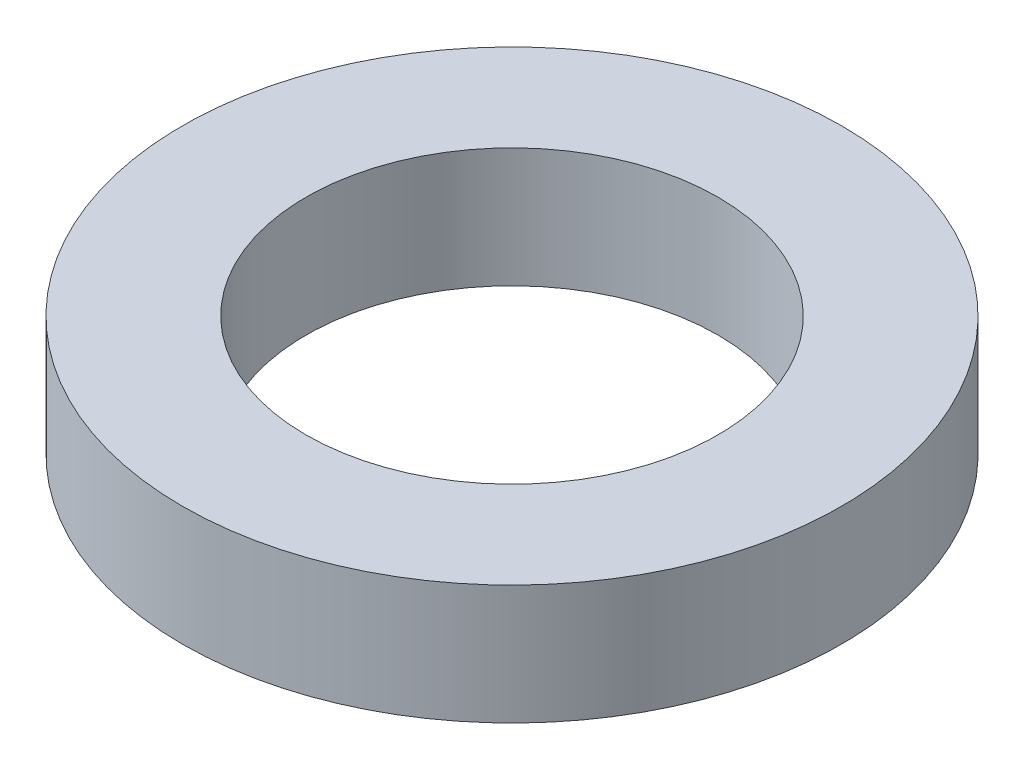
ISO-10303-21;
HEADER;
FILE_DESCRIPTION(('STEP AP214'),'2;1');
FILE_NAME('part.step','',(''),(''),'','','');
FILE_SCHEMA(('AUTOMOTIVE_DESIGN { 1 0 10303 214 1 1 1 1 }'));
ENDSEC;
DATA;
#1=APPLICATION_CONTEXT('core data for automotive mechanical design processes');
#2=APPLICATION_PROTOCOL_DEFINITION('international standard','automotive_design',2000,#1);
#3=PRODUCT_CONTEXT('',#1,'mechanical');
#4=PRODUCT('Part','Part','',(#3));
#5=PRODUCT_RELATED_PRODUCT_CATEGORY('part','',(#4));
#6=PRODUCT_DEFINITION_FORMATION('','',#4);
#7=PRODUCT_DEFINITION_CONTEXT('part definition',#1,'design');
#8=PRODUCT_DEFINITION('design','',#6,#7);
#9=PRODUCT_DEFINITION_SHAPE('','',#8);
#10=(LENGTH_UNIT() NAMED_UNIT(*) SI_UNIT(.MILLI.,.METRE.));
#11=(NAMED_UNIT(*) PLANE_ANGLE_UNIT() SI_UNIT($,.RADIAN.));
#12=(NAMED_UNIT(*) SI_UNIT($,.STERADIAN.) SOLID_ANGLE_UNIT());
#13=UNCERTAINTY_MEASURE_WITH_UNIT(LENGTH_MEASURE(1.E-05),#10,'distance_accuracy_value','');
#14=(GEOMETRIC_REPRESENTATION_CONTEXT(3) GLOBAL_UNCERTAINTY_ASSIGNED_CONTEXT((#13)) GLOBAL_UNIT_ASSIGNED_CONTEXT((#10,
#11,#12)) REPRESENTATION_CONTEXT('',''));
#15=CARTESIAN_POINT('',(0.,0.,0.));
#16=DIRECTION('',(0.,0.,1.));
#17=DIRECTION('',(1.,0.,0.));
#18=AXIS2_PLACEMENT_3D('',#15,#16,#17);
#19=CARTESIAN_POINT('',(0.,29.,0.));
#20=DIRECTION('',(0.,-1.,0.));
#21=DIRECTION('',(0.,0.,-1.));
#22=AXIS2_PLACEMENT_3D('',#19,#20,#21);
#23=CYLINDRICAL_SURFACE('',#22,80.);
#24=CARTESIAN_POINT('',(0.,29.,0.));
#25=DIRECTION('',(0.,1.,0.));
#26=DIRECTION('',(0.,0.,1.));
#27=AXIS2_PLACEMENT_3D('',#24,#25,#26);
#28=CIRCLE('',#27,80.);
#29=CARTESIAN_POINT('',(0.,29.,-80.));
#30=VERTEX_POINT('',#29);
#31=EDGE_CURVE('E10',#30,#30,#28,.T.);
#32=CARTESIAN_POINT('',(0.,0.,0.));
#33=DIRECTION('',(0.,1.,0.));
#34=DIRECTION('',(0.,0.,1.));
#35=AXIS2_PLACEMENT_3D('',#32,#33,#34);
#36=CIRCLE('',#35,80.);
#37=CARTESIAN_POINT('',(0.,0.,-80.));
#38=VERTEX_POINT('',#37);
#39=EDGE_CURVE('E37',#38,#38,#36,.T.);
#40=CARTESIAN_POINT('',(0.,29.,-80.));
#41=CARTESIAN_POINT('',(0.,28.6979166666667,-80.));
#42=CARTESIAN_POINT('',(0.,28.3958333333333,-80.));
#43=CARTESIAN_POINT('',(0.,27.7916666666667,-80.));
#44=CARTESIAN_POINT('',(0.,27.4895833333333,-80.));
#45=CARTESIAN_POINT('',(0.,26.8854166666667,-80.));
#46=CARTESIAN_POINT('',(0.,26.5833333333333,-80.));
#47=CARTESIAN_POINT('',(0.,25.9791666666667,-80.));
#48=CARTESIAN_POINT('',(0.,25.6770833333333,-80.));
#49=CARTESIAN_POINT('',(0.,25.0729166666667,-80.));
#50=CARTESIAN_POINT('',(0.,24.7708333333333,-80.));
#51=CARTESIAN_POINT('',(0.,24.1666666666667,-80.));
#52=CARTESIAN_POINT('',(0.,23.8645833333333,-80.));
#53=CARTESIAN_POINT('',(0.,23.2604166666667,-80.));
#54=CARTESIAN_POINT('',(0.,22.9583333333333,-80.));
#55=CARTESIAN_POINT('',(0.,22.3541666666667,-80.));
#56=CARTESIAN_POINT('',(0.,22.0520833333333,-80.));
#57=CARTESIAN_POINT('',(0.,21.4479166666667,-80.));
#58=CARTESIAN_POINT('',(0.,21.1458333333333,-80.));
#59=CARTESIAN_POINT('',(0.,20.5416666666667,-80.));
#60=CARTESIAN_POINT('',(0.,20.2395833333333,-80.));
#61=CARTESIAN_POINT('',(0.,19.6354166666667,-80.));
#62=CARTESIAN_POINT('',(0.,19.3333333333333,-80.));
#63=CARTESIAN_POINT('',(0.,18.7291666666667,-80.));
#64=CARTESIAN_POINT('',(0.,18.4270833333333,-80.));
#65=CARTESIAN_POINT('',(0.,17.8229166666667,-80.));
#66=CARTESIAN_POINT('',(0.,17.5208333333333,-80.));
#67=CARTESIAN_POINT('',(0.,16.9166666666667,-80.));
#68=CARTESIAN_POINT('',(0.,16.6145833333333,-80.));
#69=CARTESIAN_POINT('',(0.,16.0104166666667,-80.));
#70=CARTESIAN_POINT('',(0.,15.7083333333333,-80.));
#71=CARTESIAN_POINT('',(0.,15.1041666666667,-80.));
#72=CARTESIAN_POINT('',(0.,14.8020833333333,-80.));
#73=CARTESIAN_POINT('',(0.,14.1979166666667,-80.));
#74=CARTESIAN_POINT('',(0.,13.8958333333333,-80.));
#75=CARTESIAN_POINT('',(0.,13.2916666666667,-80.));
#76=CARTESIAN_POINT('',(0.,12.9895833333333,-80.));
#77=CARTESIAN_POINT('',(0.,12.3854166666667,-80.));
#78=CARTESIAN_POINT('',(0.,12.0833333333333,-80.));
#79=CARTESIAN_POINT('',(0.,11.4791666666667,-80.));
#80=CARTESIAN_POINT('',(0.,11.1770833333333,-80.));
#81=CARTESIAN_POINT('',(0.,10.5729166666667,-80.));
#82=CARTESIAN_POINT('',(0.,10.2708333333333,-80.));
#83=CARTESIAN_POINT('',(0.,9.66666666666667,-80.));
#84=CARTESIAN_POINT('',(0.,9.36458333333333,-80.));
#85=CARTESIAN_POINT('',(0.,8.76041666666667,-80.));
#86=CARTESIAN_POINT('',(0.,8.45833333333333,-80.));
#87=CARTESIAN_POINT('',(0.,7.85416666666667,-80.));
#88=CARTESIAN_POINT('',(0.,7.55208333333333,-80.));
#89=CARTESIAN_POINT('',(0.,6.94791666666667,-80.));
#90=CARTESIAN_POINT('',(0.,6.64583333333333,-80.));
#91=CARTESIAN_POINT('',(0.,6.04166666666667,-80.));
#92=CARTESIAN_POINT('',(0.,5.73958333333333,-80.));
#93=CARTESIAN_POINT('',(0.,5.13541666666667,-80.));
#94=CARTESIAN_POINT('',(0.,4.83333333333333,-80.));
#95=CARTESIAN_POINT('',(0.,4.22916666666667,-80.));
#96=CARTESIAN_POINT('',(0.,3.92708333333333,-80.));
#97=CARTESIAN_POINT('',(0.,3.32291666666667,-80.));
#98=CARTESIAN_POINT('',(0.,3.02083333333333,-80.));
#99=CARTESIAN_POINT('',(0.,2.41666666666667,-80.));
#100=CARTESIAN_POINT('',(0.,2.11458333333333,-80.));
#101=CARTESIAN_POINT('',(0.,1.51041666666667,-80.));
#102=CARTESIAN_POINT('',(0.,1.20833333333333,-80.));
#103=CARTESIAN_POINT('',(0.,0.604166666666667,-80.));
#104=CARTESIAN_POINT('',(0.,0.302083333333333,-80.));
#105=CARTESIAN_POINT('',(0.,0.,-80.));
#106=B_SPLINE_CURVE_WITH_KNOTS('',3,(#40,#41,#42,#43,#44,#45,#46,#47,#48,#49,#50,#51,#52,#53,
#54,#55,#56,#57,#58,#59,#60,#61,#62,#63,#64,#65,#66,#67,#68,#69,#70,#71,#72,#73,#74,#75,#76,#77,
#78,#79,#80,#81,#82,#83,#84,#85,#86,#87,#88,#89,#90,#91,#92,#93,#94,#95,#96,#97,#98,#99,#100,
#101,#102,#103,#104,#105),.UNSPECIFIED.,.F.,.F.,(4,2,2,2,2,2,2,2,2,2,2,2,2,2,2,2,2,2,2,2,2,2,2,
2,2,2,2,2,2,2,2,2,4),(0.,0.906249999999997,1.8125,2.71875,3.625,4.53125,5.4375,6.34375,7.25,
8.15625,9.0625,9.96875,10.875,11.78125,12.6875,13.59375,14.5,15.40625,16.3125,17.21875,18.125,
19.03125,19.9375,20.84375,21.75,22.65625,23.5625,24.46875,25.375,26.28125,27.1875,28.09375,29.),.UNSPECIFIED.);
#107=EDGE_CURVE('BSEAM40',#30,#38,#106,.T.);
#108=ORIENTED_EDGE('',*,*,#31,.F.);
#109=ORIENTED_EDGE('',*,*,#39,.T.);
#110=ORIENTED_EDGE('',*,*,#107,.T.);
#111=ORIENTED_EDGE('',*,*,#107,.F.);
#112=EDGE_LOOP('',(#108,#110,#109,#111));
#113=FACE_BOUND('',#112,.T.);
#114=ADVANCED_FACE('F40',(#113),#23,.T.);
#115=CARTESIAN_POINT('',(0.,29.,0.));
#116=DIRECTION('',(0.,1.,0.));
#117=DIRECTION('',(0.,0.,1.));
#118=AXIS2_PLACEMENT_3D('',#115,#116,#117);
#119=PLANE('',#118);
#120=CARTESIAN_POINT('',(0.,29.,0.));
#121=DIRECTION('',(0.,1.,0.));
#122=DIRECTION('',(0.,0.,1.));
#123=AXIS2_PLACEMENT_3D('',#120,#121,#122);
#124=CIRCLE('',#123,50.);
#125=CARTESIAN_POINT('',(0.,29.,-50.));
#126=VERTEX_POINT('',#125);
#127=EDGE_CURVE('E50',#126,#126,#124,.T.);
#128=ORIENTED_EDGE('',*,*,#127,.F.);
#129=EDGE_LOOP('',(#128));
#130=FACE_BOUND('',#129,.T.);
#131=ORIENTED_EDGE('',*,*,#31,.T.);
#132=EDGE_LOOP('',(#131));
#133=FACE_BOUND('',#132,.T.);
#134=ADVANCED_FACE('F59',(#130,#133),#119,.T.);
#135=CARTESIAN_POINT('',(0.,0.,0.));
#136=DIRECTION('',(0.,1.,0.));
#137=DIRECTION('',(0.,0.,1.));
#138=AXIS2_PLACEMENT_3D('',#135,#136,#137);
#139=PLANE('',#138);
#140=CARTESIAN_POINT('',(0.,0.,0.));
#141=DIRECTION('',(0.,1.,0.));
#142=DIRECTION('',(0.,0.,1.));
#143=AXIS2_PLACEMENT_3D('',#140,#141,#142);
#144=CIRCLE('',#143,50.);
#145=CARTESIAN_POINT('',(0.,0.,-50.));
#146=VERTEX_POINT('',#145);
#147=EDGE_CURVE('E47',#146,#146,#144,.T.);
#148=ORIENTED_EDGE('',*,*,#147,.T.);
#149=EDGE_LOOP('',(#148));
#150=FACE_BOUND('',#149,.T.);
#151=ORIENTED_EDGE('',*,*,#39,.F.);
#152=EDGE_LOOP('',(#151));
#153=FACE_BOUND('',#152,.T.);
#154=ADVANCED_FACE('F58',(#150,#153),#139,.F.);
#155=CARTESIAN_POINT('',(0.,29.,0.));
#156=DIRECTION('',(0.,-1.,0.));
#157=DIRECTION('',(0.,0.,-1.));
#158=AXIS2_PLACEMENT_3D('',#155,#156,#157);
#159=CYLINDRICAL_SURFACE('',#158,50.);
#160=CARTESIAN_POINT('',(0.,29.,-50.));
#161=CARTESIAN_POINT('',(0.,28.6979166666667,-50.));
#162=CARTESIAN_POINT('',(0.,28.3958333333333,-50.));
#163=CARTESIAN_POINT('',(0.,27.7916666666667,-50.));
#164=CARTESIAN_POINT('',(0.,27.4895833333333,-50.));
#165=CARTESIAN_POINT('',(0.,26.8854166666667,-50.));
#166=CARTESIAN_POINT('',(0.,26.5833333333333,-50.));
#167=CARTESIAN_POINT('',(0.,25.9791666666667,-50.));
#168=CARTESIAN_POINT('',(0.,25.6770833333333,-50.));
#169=CARTESIAN_POINT('',(0.,25.0729166666667,-50.));
#170=CARTESIAN_POINT('',(0.,24.7708333333333,-50.));
#171=CARTESIAN_POINT('',(0.,24.1666666666667,-50.));
#172=CARTESIAN_POINT('',(0.,23.8645833333333,-50.));
#173=CARTESIAN_POINT('',(0.,23.2604166666667,-50.));
#174=CARTESIAN_POINT('',(0.,22.9583333333333,-50.));
#175=CARTESIAN_POINT('',(0.,22.3541666666667,-50.));
#176=CARTESIAN_POINT('',(0.,22.0520833333333,-50.));
#177=CARTESIAN_POINT('',(0.,21.4479166666667,-50.));
#178=CARTESIAN_POINT('',(0.,21.1458333333333,-50.));
#179=CARTESIAN_POINT('',(0.,20.5416666666667,-50.));
#180=CARTESIAN_POINT('',(0.,20.2395833333333,-50.));
#181=CARTESIAN_POINT('',(0.,19.6354166666667,-50.));
#182=CARTESIAN_POINT('',(0.,19.3333333333333,-50.));
#183=CARTESIAN_POINT('',(0.,18.7291666666667,-50.));
#184=CARTESIAN_POINT('',(0.,18.4270833333333,-50.));
#185=CARTESIAN_POINT('',(0.,17.8229166666667,-50.));
#186=CARTESIAN_POINT('',(0.,17.5208333333333,-50.));
#187=CARTESIAN_POINT('',(0.,16.9166666666667,-50.));
#188=CARTESIAN_POINT('',(0.,16.6145833333333,-50.));
#189=CARTESIAN_POINT('',(0.,16.0104166666667,-50.));
#190=CARTESIAN_POINT('',(0.,15.7083333333333,-50.));
#191=CARTESIAN_POINT('',(0.,15.1041666666667,-50.));
#192=CARTESIAN_POINT('',(0.,14.8020833333333,-50.));
#193=CARTESIAN_POINT('',(0.,14.1979166666667,-50.));
#194=CARTESIAN_POINT('',(0.,13.8958333333333,-50.));
#195=CARTESIAN_POINT('',(0.,13.2916666666667,-50.));
#196=CARTESIAN_POINT('',(0.,12.9895833333333,-50.));
#197=CARTESIAN_POINT('',(0.,12.3854166666667,-50.));
#198=CARTESIAN_POINT('',(0.,12.0833333333333,-50.));
#199=CARTESIAN_POINT('',(0.,11.4791666666667,-50.));
#200=CARTESIAN_POINT('',(0.,11.1770833333333,-50.));
#201=CARTESIAN_POINT('',(0.,10.5729166666667,-50.));
#202=CARTESIAN_POINT('',(0.,10.2708333333333,-50.));
#203=CARTESIAN_POINT('',(0.,9.66666666666667,-50.));
#204=CARTESIAN_POINT('',(0.,9.36458333333333,-50.));
#205=CARTESIAN_POINT('',(0.,8.76041666666667,-50.));
#206=CARTESIAN_POINT('',(0.,8.45833333333333,-50.));
#207=CARTESIAN_POINT('',(0.,7.85416666666667,-50.));
#208=CARTESIAN_POINT('',(0.,7.55208333333333,-50.));
#209=CARTESIAN_POINT('',(0.,6.94791666666667,-50.));
#210=CARTESIAN_POINT('',(0.,6.64583333333333,-50.));
#211=CARTESIAN_POINT('',(0.,6.04166666666667,-50.));
#212=CARTESIAN_POINT('',(0.,5.73958333333333,-50.));
#213=CARTESIAN_POINT('',(0.,5.13541666666667,-50.));
#214=CARTESIAN_POINT('',(0.,4.83333333333333,-50.));
#215=CARTESIAN_POINT('',(0.,4.22916666666667,-50.));
#216=CARTESIAN_POINT('',(0.,3.92708333333333,-50.));
#217=CARTESIAN_POINT('',(0.,3.32291666666667,-50.));
#218=CARTESIAN_POINT('',(0.,3.02083333333333,-50.));
#219=CARTESIAN_POINT('',(0.,2.41666666666667,-50.));
#220=CARTESIAN_POINT('',(0.,2.11458333333333,-50.));
#221=CARTESIAN_POINT('',(0.,1.51041666666667,-50.));
#222=CARTESIAN_POINT('',(0.,1.20833333333333,-50.));
#223=CARTESIAN_POINT('',(0.,0.604166666666667,-50.));
#224=CARTESIAN_POINT('',(0.,0.302083333333333,-50.));
#225=CARTESIAN_POINT('',(0.,0.,-50.));
#226=B_SPLINE_CURVE_WITH_KNOTS('',3,(#160,#161,#162,#163,#164,#165,#166,#167,#168,#169,#170,
#171,#172,#173,#174,#175,#176,#177,#178,#179,#180,#181,#182,#183,#184,#185,#186,#187,#188,#189,
#190,#191,#192,#193,#194,#195,#196,#197,#198,#199,#200,#201,#202,#203,#204,#205,#206,#207,#208,
#209,#210,#211,#212,#213,#214,#215,#216,#217,#218,#219,#220,#221,#222,#223,#224,#225),
.UNSPECIFIED.,.F.,.F.,(4,2,2,2,2,2,2,2,2,2,2,2,2,2,2,2,2,2,2,2,2,2,2,2,2,2,2,2,2,2,2,2,4),(0.,
0.906250000000001,1.8125,2.71875,3.625,4.53125,5.4375,6.34375,7.25,8.15625,9.0625,9.96875,
10.875,11.78125,12.6875,13.59375,14.5,15.40625,16.3125,17.21875,18.125,19.03125,19.9375,
20.84375,21.75,22.65625,23.5625,24.46875,25.375,26.28125,27.1875,28.09375,29.),.UNSPECIFIED.);
#227=EDGE_CURVE('BSEAM54',#126,#146,#226,.T.);
#228=ORIENTED_EDGE('',*,*,#127,.T.);
#229=ORIENTED_EDGE('',*,*,#147,.F.);
#230=ORIENTED_EDGE('',*,*,#227,.T.);
#231=ORIENTED_EDGE('',*,*,#227,.F.);
#232=EDGE_LOOP('',(#228,#230,#229,#231));
#233=FACE_BOUND('',#232,.T.);
#234=ADVANCED_FACE('F54',(#233),#159,.F.);
#235=CLOSED_SHELL('',(#114,#134,#154,#234));
#236=MANIFOLD_SOLID_BREP('B2',#235);
#237=ADVANCED_BREP_SHAPE_REPRESENTATION('',(#18,#236),#14);
#238=SHAPE_DEFINITION_REPRESENTATION(#9,#237);
ENDSEC;
END-ISO-10303-21;
